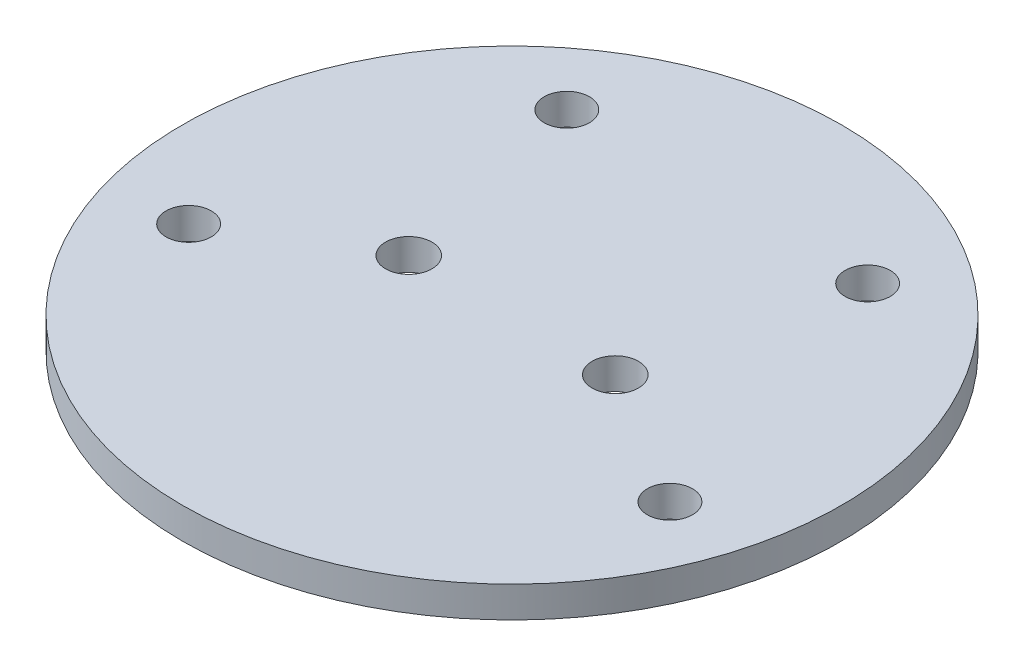
ISO-10303-21;
HEADER;
FILE_DESCRIPTION(('STEP AP214'),'2;1');
FILE_NAME('part.step','',(''),(''),'','','');
FILE_SCHEMA(('AUTOMOTIVE_DESIGN { 1 0 10303 214 1 1 1 1 }'));
ENDSEC;
DATA;
#1=APPLICATION_CONTEXT('core data for automotive mechanical design processes');
#2=APPLICATION_PROTOCOL_DEFINITION('international standard','automotive_design',2000,#1);
#3=PRODUCT_CONTEXT('',#1,'mechanical');
#4=PRODUCT('Part','Part','',(#3));
#5=PRODUCT_RELATED_PRODUCT_CATEGORY('part','',(#4));
#6=PRODUCT_DEFINITION_FORMATION('','',#4);
#7=PRODUCT_DEFINITION_CONTEXT('part definition',#1,'design');
#8=PRODUCT_DEFINITION('design','',#6,#7);
#9=PRODUCT_DEFINITION_SHAPE('','',#8);
#10=(LENGTH_UNIT() NAMED_UNIT(*) SI_UNIT(.MILLI.,.METRE.));
#11=(NAMED_UNIT(*) PLANE_ANGLE_UNIT() SI_UNIT($,.RADIAN.));
#12=(NAMED_UNIT(*) SI_UNIT($,.STERADIAN.) SOLID_ANGLE_UNIT());
#13=UNCERTAINTY_MEASURE_WITH_UNIT(LENGTH_MEASURE(1.E-05),#10,'distance_accuracy_value','');
#14=(GEOMETRIC_REPRESENTATION_CONTEXT(3) GLOBAL_UNCERTAINTY_ASSIGNED_CONTEXT((#13)) GLOBAL_UNIT_ASSIGNED_CONTEXT((#10,
#11,#12)) REPRESENTATION_CONTEXT('',''));
#15=CARTESIAN_POINT('',(0.,0.,0.));
#16=DIRECTION('',(0.,0.,1.));
#17=DIRECTION('',(1.,0.,0.));
#18=AXIS2_PLACEMENT_3D('',#15,#16,#17);
#19=CARTESIAN_POINT('',(0.,4.7752,0.));
#20=DIRECTION('',(0.,1.,0.));
#21=DIRECTION('',(0.,0.,1.));
#22=AXIS2_PLACEMENT_3D('',#19,#20,#21);
#23=PLANE('',#22);
#24=CARTESIAN_POINT('',(23.1297303497822,4.7752,-31.5565202836558));
#25=DIRECTION('',(0.,1.,0.));
#26=DIRECTION('',(0.,0.,-1.));
#27=AXIS2_PLACEMENT_3D('',#24,#25,#26);
#28=CIRCLE('',#27,3.475000035);
#29=CARTESIAN_POINT('',(23.1297303497822,4.7752,-35.0315203186558));
#30=VERTEX_POINT('',#29);
#31=EDGE_CURVE('E79',#30,#30,#28,.T.);
#32=ORIENTED_EDGE('',*,*,#31,.F.);
#33=EDGE_LOOP('',(#32));
#34=FACE_BOUND('',#33,.T.);
#35=CARTESIAN_POINT('',(-15.875,4.7752,0.));
#36=DIRECTION('',(0.,1.,0.));
#37=DIRECTION('',(0.,0.,1.));
#38=AXIS2_PLACEMENT_3D('',#35,#36,#37);
#39=CIRCLE('',#38,3.5687);
#40=CARTESIAN_POINT('',(-15.875,4.7752,3.5687));
#41=VERTEX_POINT('',#40);
#42=EDGE_CURVE('E66',#41,#41,#39,.T.);
#43=ORIENTED_EDGE('',*,*,#42,.F.);
#44=EDGE_LOOP('',(#43));
#45=FACE_BOUND('',#44,.T.);
#46=CARTESIAN_POINT('',(-37.0004748048183,4.7752,12.7186187412166));
#47=DIRECTION('',(0.,1.,0.));
#48=DIRECTION('',(0.,0.,1.));
#49=AXIS2_PLACEMENT_3D('',#46,#47,#48);
#50=CIRCLE('',#49,3.475000035);
#51=CARTESIAN_POINT('',(-37.0004748048183,4.7752,16.1936187762166));
#52=VERTEX_POINT('',#51);
#53=EDGE_CURVE('E55',#52,#52,#50,.T.);
#54=ORIENTED_EDGE('',*,*,#53,.F.);
#55=EDGE_LOOP('',(#54));
#56=FACE_BOUND('',#55,.T.);
#57=CARTESIAN_POINT('',(0.,4.7752,0.));
#58=DIRECTION('',(0.,1.,0.));
#59=DIRECTION('',(0.,0.,1.));
#60=AXIS2_PLACEMENT_3D('',#57,#58,#59);
#61=CIRCLE('',#60,50.673);
#62=CARTESIAN_POINT('',(0.,4.7752,50.673));
#63=VERTEX_POINT('',#62);
#64=EDGE_CURVE('E10',#63,#63,#61,.T.);
#65=ORIENTED_EDGE('',*,*,#64,.T.);
#66=EDGE_LOOP('',(#65));
#67=FACE_BOUND('',#66,.T.);
#68=CARTESIAN_POINT('',(-23.1297303497822,4.7752,-31.5565202836558));
#69=DIRECTION('',(0.,1.,0.));
#70=DIRECTION('',(0.,0.,1.));
#71=AXIS2_PLACEMENT_3D('',#68,#69,#70);
#72=CIRCLE('',#71,3.475000035);
#73=CARTESIAN_POINT('',(-23.1297303497822,4.7752,-28.0815202486558));
#74=VERTEX_POINT('',#73);
#75=EDGE_CURVE('E60',#74,#74,#72,.T.);
#76=ORIENTED_EDGE('',*,*,#75,.F.);
#77=EDGE_LOOP('',(#76));
#78=FACE_BOUND('',#77,.T.);
#79=CARTESIAN_POINT('',(15.875,4.7752,0.));
#80=DIRECTION('',(0.,1.,0.));
#81=DIRECTION('',(0.,0.,1.));
#82=AXIS2_PLACEMENT_3D('',#79,#80,#81);
#83=CIRCLE('',#82,3.5687);
#84=CARTESIAN_POINT('',(15.875,4.7752,3.5687));
#85=VERTEX_POINT('',#84);
#86=EDGE_CURVE('E72',#85,#85,#83,.T.);
#87=ORIENTED_EDGE('',*,*,#86,.F.);
#88=EDGE_LOOP('',(#87));
#89=FACE_BOUND('',#88,.T.);
#90=CARTESIAN_POINT('',(37.0004748048183,4.7752,12.7186187412166));
#91=DIRECTION('',(0.,1.,0.));
#92=DIRECTION('',(0.,0.,-1.));
#93=AXIS2_PLACEMENT_3D('',#90,#91,#92);
#94=CIRCLE('',#93,3.475000035);
#95=CARTESIAN_POINT('',(37.0004748048183,4.7752,9.24361870621661));
#96=VERTEX_POINT('',#95);
#97=EDGE_CURVE('E85',#96,#96,#94,.T.);
#98=ORIENTED_EDGE('',*,*,#97,.F.);
#99=EDGE_LOOP('',(#98));
#100=FACE_BOUND('',#99,.T.);
#101=ADVANCED_FACE('F41',(#34,#45,#56,#67,#78,#89,#100),#23,.T.);
#102=CARTESIAN_POINT('',(0.,0.,0.));
#103=DIRECTION('',(0.,1.,0.));
#104=DIRECTION('',(0.,0.,1.));
#105=AXIS2_PLACEMENT_3D('',#102,#103,#104);
#106=PLANE('',#105);
#107=CARTESIAN_POINT('',(0.,0.,0.));
#108=DIRECTION('',(0.,1.,0.));
#109=DIRECTION('',(0.,0.,1.));
#110=AXIS2_PLACEMENT_3D('',#107,#108,#109);
#111=CIRCLE('',#110,50.673);
#112=CARTESIAN_POINT('',(0.,0.,50.673));
#113=VERTEX_POINT('',#112);
#114=EDGE_CURVE('E45',#113,#113,#111,.T.);
#115=ORIENTED_EDGE('',*,*,#114,.F.);
#116=EDGE_LOOP('',(#115));
#117=FACE_BOUND('',#116,.T.);
#118=CARTESIAN_POINT('',(-37.0004748048183,0.,12.7186187412166));
#119=DIRECTION('',(0.,1.,0.));
#120=DIRECTION('',(0.,0.,1.));
#121=AXIS2_PLACEMENT_3D('',#118,#119,#120);
#122=CIRCLE('',#121,3.475000035);
#123=CARTESIAN_POINT('',(-37.0004748048183,0.,16.1936187762166));
#124=VERTEX_POINT('',#123);
#125=EDGE_CURVE('E57',#124,#124,#122,.T.);
#126=ORIENTED_EDGE('',*,*,#125,.T.);
#127=EDGE_LOOP('',(#126));
#128=FACE_BOUND('',#127,.T.);
#129=CARTESIAN_POINT('',(-23.1297303497822,0.,-31.5565202836558));
#130=DIRECTION('',(0.,1.,0.));
#131=DIRECTION('',(0.,0.,1.));
#132=AXIS2_PLACEMENT_3D('',#129,#130,#131);
#133=CIRCLE('',#132,3.475000035);
#134=CARTESIAN_POINT('',(-23.1297303497822,0.,-28.0815202486558));
#135=VERTEX_POINT('',#134);
#136=EDGE_CURVE('E63',#135,#135,#133,.T.);
#137=ORIENTED_EDGE('',*,*,#136,.T.);
#138=EDGE_LOOP('',(#137));
#139=FACE_BOUND('',#138,.T.);
#140=CARTESIAN_POINT('',(-15.875,0.,0.));
#141=DIRECTION('',(0.,1.,0.));
#142=DIRECTION('',(0.,0.,1.));
#143=AXIS2_PLACEMENT_3D('',#140,#141,#142);
#144=CIRCLE('',#143,3.5687);
#145=CARTESIAN_POINT('',(-15.875,0.,3.5687));
#146=VERTEX_POINT('',#145);
#147=EDGE_CURVE('E69',#146,#146,#144,.T.);
#148=ORIENTED_EDGE('',*,*,#147,.T.);
#149=EDGE_LOOP('',(#148));
#150=FACE_BOUND('',#149,.T.);
#151=CARTESIAN_POINT('',(15.875,0.,0.));
#152=DIRECTION('',(0.,1.,0.));
#153=DIRECTION('',(0.,0.,1.));
#154=AXIS2_PLACEMENT_3D('',#151,#152,#153);
#155=CIRCLE('',#154,3.5687);
#156=CARTESIAN_POINT('',(15.875,0.,3.5687));
#157=VERTEX_POINT('',#156);
#158=EDGE_CURVE('E75',#157,#157,#155,.T.);
#159=ORIENTED_EDGE('',*,*,#158,.T.);
#160=EDGE_LOOP('',(#159));
#161=FACE_BOUND('',#160,.T.);
#162=CARTESIAN_POINT('',(23.1297303497822,0.,-31.5565202836558));
#163=DIRECTION('',(0.,1.,0.));
#164=DIRECTION('',(0.,0.,-1.));
#165=AXIS2_PLACEMENT_3D('',#162,#163,#164);
#166=CIRCLE('',#165,3.475000035);
#167=CARTESIAN_POINT('',(23.1297303497822,0.,-35.0315203186558));
#168=VERTEX_POINT('',#167);
#169=EDGE_CURVE('E82',#168,#168,#166,.T.);
#170=ORIENTED_EDGE('',*,*,#169,.T.);
#171=EDGE_LOOP('',(#170));
#172=FACE_BOUND('',#171,.T.);
#173=CARTESIAN_POINT('',(37.0004748048183,0.,12.7186187412166));
#174=DIRECTION('',(0.,1.,0.));
#175=DIRECTION('',(0.,0.,-1.));
#176=AXIS2_PLACEMENT_3D('',#173,#174,#175);
#177=CIRCLE('',#176,3.475000035);
#178=CARTESIAN_POINT('',(37.0004748048183,0.,9.24361870621661));
#179=VERTEX_POINT('',#178);
#180=EDGE_CURVE('E88',#179,#179,#177,.T.);
#181=ORIENTED_EDGE('',*,*,#180,.T.);
#182=EDGE_LOOP('',(#181));
#183=FACE_BOUND('',#182,.T.);
#184=ADVANCED_FACE('F100',(#117,#128,#139,#150,#161,#172,#183),#106,.F.);
#185=CARTESIAN_POINT('',(0.,4.7752,0.));
#186=DIRECTION('',(0.,-1.,0.));
#187=DIRECTION('',(0.,0.,-1.));
#188=AXIS2_PLACEMENT_3D('',#185,#186,#187);
#189=CYLINDRICAL_SURFACE('',#188,50.673);
#190=ORIENTED_EDGE('',*,*,#64,.F.);
#191=EDGE_LOOP('',(#190));
#192=FACE_BOUND('',#191,.T.);
#193=ORIENTED_EDGE('',*,*,#114,.T.);
#194=EDGE_LOOP('',(#193));
#195=FACE_BOUND('',#194,.T.);
#196=ADVANCED_FACE('F43',(#192,#195),#189,.T.);
#197=CARTESIAN_POINT('',(-37.0004748048183,4.7752,12.7186187412166));
#198=DIRECTION('',(0.,-1.,0.));
#199=DIRECTION('',(0.,0.,-1.));
#200=AXIS2_PLACEMENT_3D('',#197,#198,#199);
#201=CYLINDRICAL_SURFACE('',#200,3.475000035);
#202=ORIENTED_EDGE('',*,*,#53,.T.);
#203=EDGE_LOOP('',(#202));
#204=FACE_BOUND('',#203,.T.);
#205=ORIENTED_EDGE('',*,*,#125,.F.);
#206=EDGE_LOOP('',(#205));
#207=FACE_BOUND('',#206,.T.);
#208=ADVANCED_FACE('F110',(#204,#207),#201,.F.);
#209=CARTESIAN_POINT('',(-23.1297303497822,4.7752,-31.5565202836558));
#210=DIRECTION('',(0.,-1.,0.));
#211=DIRECTION('',(0.,0.,-1.));
#212=AXIS2_PLACEMENT_3D('',#209,#210,#211);
#213=CYLINDRICAL_SURFACE('',#212,3.475000035);
#214=ORIENTED_EDGE('',*,*,#75,.T.);
#215=EDGE_LOOP('',(#214));
#216=FACE_BOUND('',#215,.T.);
#217=ORIENTED_EDGE('',*,*,#136,.F.);
#218=EDGE_LOOP('',(#217));
#219=FACE_BOUND('',#218,.T.);
#220=ADVANCED_FACE('F113',(#216,#219),#213,.F.);
#221=CARTESIAN_POINT('',(-15.875,4.7752,0.));
#222=DIRECTION('',(0.,-1.,0.));
#223=DIRECTION('',(0.,0.,-1.));
#224=AXIS2_PLACEMENT_3D('',#221,#222,#223);
#225=CYLINDRICAL_SURFACE('',#224,3.5687);
#226=ORIENTED_EDGE('',*,*,#42,.T.);
#227=EDGE_LOOP('',(#226));
#228=FACE_BOUND('',#227,.T.);
#229=ORIENTED_EDGE('',*,*,#147,.F.);
#230=EDGE_LOOP('',(#229));
#231=FACE_BOUND('',#230,.T.);
#232=ADVANCED_FACE('F117',(#228,#231),#225,.F.);
#233=CARTESIAN_POINT('',(15.875,4.7752,0.));
#234=DIRECTION('',(0.,-1.,0.));
#235=DIRECTION('',(0.,0.,-1.));
#236=AXIS2_PLACEMENT_3D('',#233,#234,#235);
#237=CYLINDRICAL_SURFACE('',#236,3.5687);
#238=ORIENTED_EDGE('',*,*,#86,.T.);
#239=EDGE_LOOP('',(#238));
#240=FACE_BOUND('',#239,.T.);
#241=ORIENTED_EDGE('',*,*,#158,.F.);
#242=EDGE_LOOP('',(#241));
#243=FACE_BOUND('',#242,.T.);
#244=ADVANCED_FACE('F121',(#240,#243),#237,.F.);
#245=CARTESIAN_POINT('',(23.1297303497822,4.7752,-31.5565202836558));
#246=DIRECTION('',(0.,-1.,0.));
#247=DIRECTION('',(0.,0.,-1.));
#248=AXIS2_PLACEMENT_3D('',#245,#246,#247);
#249=CYLINDRICAL_SURFACE('',#248,3.475000035);
#250=ORIENTED_EDGE('',*,*,#31,.T.);
#251=EDGE_LOOP('',(#250));
#252=FACE_BOUND('',#251,.T.);
#253=ORIENTED_EDGE('',*,*,#169,.F.);
#254=EDGE_LOOP('',(#253));
#255=FACE_BOUND('',#254,.T.);
#256=ADVANCED_FACE('F125',(#252,#255),#249,.F.);
#257=CARTESIAN_POINT('',(37.0004748048183,4.7752,12.7186187412166));
#258=DIRECTION('',(0.,-1.,0.));
#259=DIRECTION('',(0.,0.,-1.));
#260=AXIS2_PLACEMENT_3D('',#257,#258,#259);
#261=CYLINDRICAL_SURFACE('',#260,3.475000035);
#262=ORIENTED_EDGE('',*,*,#97,.T.);
#263=EDGE_LOOP('',(#262));
#264=FACE_BOUND('',#263,.T.);
#265=ORIENTED_EDGE('',*,*,#180,.F.);
#266=EDGE_LOOP('',(#265));
#267=FACE_BOUND('',#266,.T.);
#268=ADVANCED_FACE('F96',(#264,#267),#261,.F.);
#269=CLOSED_SHELL('',(#101,#184,#196,#208,#220,#232,#244,#256,#268));
#270=MANIFOLD_SOLID_BREP('B2',#269);
#271=ADVANCED_BREP_SHAPE_REPRESENTATION('',(#18,#270),#14);
#272=SHAPE_DEFINITION_REPRESENTATION(#9,#271);
ENDSEC;
END-ISO-10303-21;
